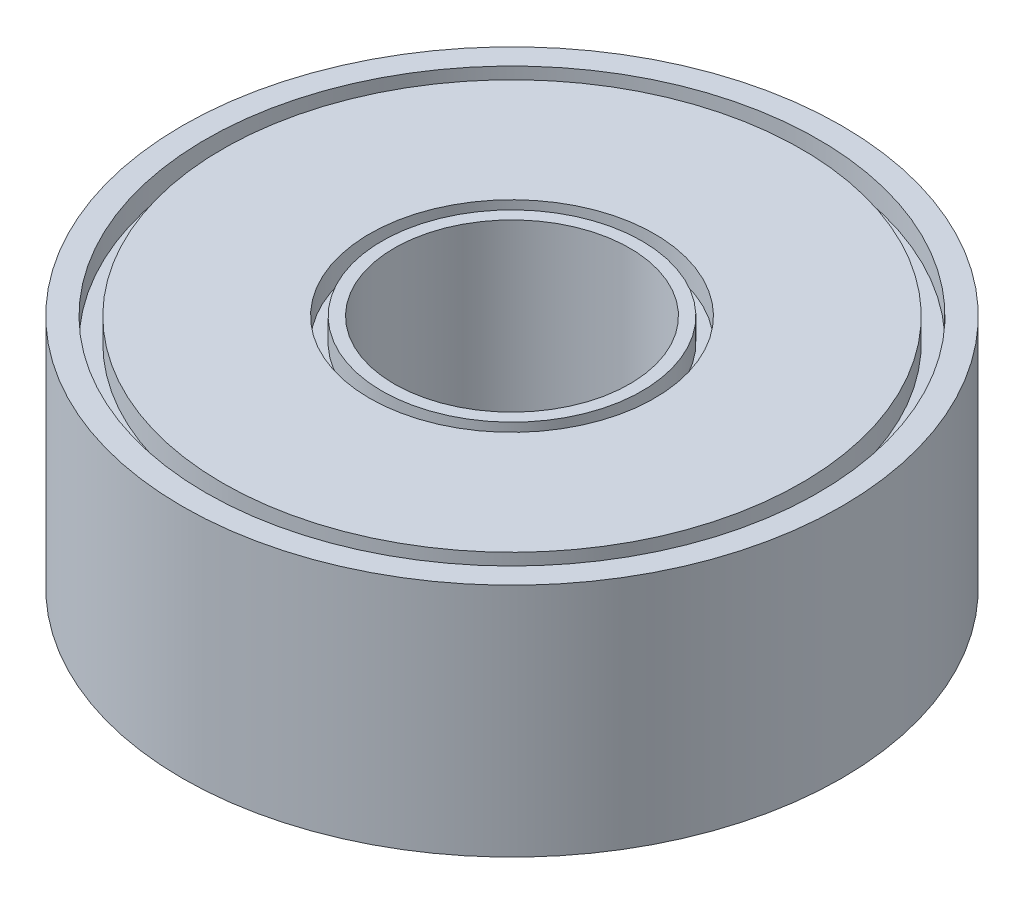
ISO-10303-21;
HEADER;
FILE_DESCRIPTION(('STEP AP214'),'2;1');
FILE_NAME('part.step','',(''),(''),'','','');
FILE_SCHEMA(('AUTOMOTIVE_DESIGN { 1 0 10303 214 1 1 1 1 }'));
ENDSEC;
DATA;
#1=APPLICATION_CONTEXT('core data for automotive mechanical design processes');
#2=APPLICATION_PROTOCOL_DEFINITION('international standard','automotive_design',2000,#1);
#3=PRODUCT_CONTEXT('',#1,'mechanical');
#4=PRODUCT('Part','Part','',(#3));
#5=PRODUCT_RELATED_PRODUCT_CATEGORY('part','',(#4));
#6=PRODUCT_DEFINITION_FORMATION('','',#4);
#7=PRODUCT_DEFINITION_CONTEXT('part definition',#1,'design');
#8=PRODUCT_DEFINITION('design','',#6,#7);
#9=PRODUCT_DEFINITION_SHAPE('','',#8);
#10=(LENGTH_UNIT() NAMED_UNIT(*) SI_UNIT(.MILLI.,.METRE.));
#11=(NAMED_UNIT(*) PLANE_ANGLE_UNIT() SI_UNIT($,.RADIAN.));
#12=(NAMED_UNIT(*) SI_UNIT($,.STERADIAN.) SOLID_ANGLE_UNIT());
#13=UNCERTAINTY_MEASURE_WITH_UNIT(LENGTH_MEASURE(1.E-05),#10,'distance_accuracy_value','');
#14=(GEOMETRIC_REPRESENTATION_CONTEXT(3) GLOBAL_UNCERTAINTY_ASSIGNED_CONTEXT((#13)) GLOBAL_UNIT_ASSIGNED_CONTEXT((#10,
#11,#12)) REPRESENTATION_CONTEXT('',''));
#15=CARTESIAN_POINT('',(0.,0.,0.));
#16=DIRECTION('',(0.,0.,1.));
#17=DIRECTION('',(1.,0.,0.));
#18=AXIS2_PLACEMENT_3D('',#15,#16,#17);
#19=CARTESIAN_POINT('',(0.,0.,0.));
#20=DIRECTION('',(0.,1.,0.));
#21=DIRECTION('',(0.,0.,1.));
#22=AXIS2_PLACEMENT_3D('',#19,#20,#21);
#23=PLANE('',#22);
#24=CARTESIAN_POINT('',(0.,0.,0.));
#25=DIRECTION('',(0.,-1.,0.));
#26=DIRECTION('',(0.,0.,-1.));
#27=AXIS2_PLACEMENT_3D('',#24,#25,#26);
#28=CIRCLE('',#27,3.2118954980683);
#29=CARTESIAN_POINT('',(0.,0.,-3.2118954980683));
#30=VERTEX_POINT('',#29);
#31=EDGE_CURVE('E111',#30,#30,#28,.T.);
#32=ORIENTED_EDGE('',*,*,#31,.F.);
#33=EDGE_LOOP('',(#32));
#34=FACE_BOUND('',#33,.T.);
#35=CARTESIAN_POINT('',(0.,0.,0.));
#36=DIRECTION('',(0.,-1.,0.));
#37=DIRECTION('',(0.,0.,-1.));
#38=AXIS2_PLACEMENT_3D('',#35,#36,#37);
#39=CIRCLE('',#38,6.40297161324171);
#40=CARTESIAN_POINT('',(0.,0.,-6.40297161324171));
#41=VERTEX_POINT('',#40);
#42=EDGE_CURVE('E120',#41,#41,#39,.T.);
#43=ORIENTED_EDGE('',*,*,#42,.T.);
#44=EDGE_LOOP('',(#43));
#45=FACE_BOUND('',#44,.T.);
#46=ADVANCED_FACE('F68',(#34,#45),#23,.F.);
#47=CARTESIAN_POINT('',(0.,0.,0.));
#48=DIRECTION('',(0.,1.,0.));
#49=DIRECTION('',(0.,0.,1.));
#50=AXIS2_PLACEMENT_3D('',#47,#48,#49);
#51=CIRCLE('',#50,2.5);
#52=CARTESIAN_POINT('',(0.,0.,2.5));
#53=VERTEX_POINT('',#52);
#54=EDGE_CURVE('E81',#53,#53,#51,.T.);
#55=ORIENTED_EDGE('',*,*,#54,.T.);
#56=EDGE_LOOP('',(#55));
#57=FACE_BOUND('',#56,.T.);
#58=CARTESIAN_POINT('',(0.,0.,0.));
#59=DIRECTION('',(0.,-1.,0.));
#60=DIRECTION('',(0.,0.,-1.));
#61=AXIS2_PLACEMENT_3D('',#58,#59,#60);
#62=CIRCLE('',#61,2.91485272981181);
#63=CARTESIAN_POINT('',(0.,0.,-2.91485272981181));
#64=VERTEX_POINT('',#63);
#65=EDGE_CURVE('E117',#64,#64,#62,.T.);
#66=ORIENTED_EDGE('',*,*,#65,.T.);
#67=EDGE_LOOP('',(#66));
#68=FACE_BOUND('',#67,.T.);
#69=ADVANCED_FACE('F141',(#57,#68),#23,.F.);
#70=CARTESIAN_POINT('',(0.,5.,0.));
#71=DIRECTION('',(0.,1.,0.));
#72=DIRECTION('',(0.,0.,1.));
#73=AXIS2_PLACEMENT_3D('',#70,#71,#72);
#74=PLANE('',#73);
#75=CARTESIAN_POINT('',(0.,5.,0.));
#76=DIRECTION('',(0.,1.,0.));
#77=DIRECTION('',(0.,0.,1.));
#78=AXIS2_PLACEMENT_3D('',#75,#76,#77);
#79=CIRCLE('',#78,3.02471914204805);
#80=CARTESIAN_POINT('',(0.,5.,3.02471914204805));
#81=VERTEX_POINT('',#80);
#82=EDGE_CURVE('E87',#81,#81,#79,.T.);
#83=ORIENTED_EDGE('',*,*,#82,.F.);
#84=EDGE_LOOP('',(#83));
#85=FACE_BOUND('',#84,.T.);
#86=CARTESIAN_POINT('',(0.,5.,0.));
#87=DIRECTION('',(0.,1.,0.));
#88=DIRECTION('',(0.,0.,1.));
#89=AXIS2_PLACEMENT_3D('',#86,#87,#88);
#90=CIRCLE('',#89,6.14365339120584);
#91=CARTESIAN_POINT('',(0.,5.,6.14365339120584));
#92=VERTEX_POINT('',#91);
#93=EDGE_CURVE('E105',#92,#92,#90,.T.);
#94=ORIENTED_EDGE('',*,*,#93,.T.);
#95=EDGE_LOOP('',(#94));
#96=FACE_BOUND('',#95,.T.);
#97=ADVANCED_FACE('F158',(#85,#96),#74,.T.);
#98=CARTESIAN_POINT('',(0.,5.,0.));
#99=DIRECTION('',(0.,1.,0.));
#100=DIRECTION('',(0.,0.,1.));
#101=AXIS2_PLACEMENT_3D('',#98,#99,#100);
#102=CIRCLE('',#101,2.5);
#103=CARTESIAN_POINT('',(0.,5.,2.5));
#104=VERTEX_POINT('',#103);
#105=EDGE_CURVE('E79',#104,#104,#102,.T.);
#106=ORIENTED_EDGE('',*,*,#105,.F.);
#107=EDGE_LOOP('',(#106));
#108=FACE_BOUND('',#107,.T.);
#109=CARTESIAN_POINT('',(0.,5.,0.));
#110=DIRECTION('',(0.,1.,0.));
#111=DIRECTION('',(0.,0.,1.));
#112=AXIS2_PLACEMENT_3D('',#109,#110,#111);
#113=CIRCLE('',#112,2.76023768733502);
#114=CARTESIAN_POINT('',(0.,5.,2.76023768733502));
#115=VERTEX_POINT('',#114);
#116=EDGE_CURVE('E93',#115,#115,#113,.T.);
#117=ORIENTED_EDGE('',*,*,#116,.T.);
#118=EDGE_LOOP('',(#117));
#119=FACE_BOUND('',#118,.T.);
#120=ADVANCED_FACE('F164',(#108,#119),#74,.T.);
#121=CARTESIAN_POINT('',(0.,5.,0.));
#122=DIRECTION('',(0.,1.,0.));
#123=DIRECTION('',(0.,0.,1.));
#124=AXIS2_PLACEMENT_3D('',#121,#122,#123);
#125=CIRCLE('',#124,6.50095153113644);
#126=CARTESIAN_POINT('',(0.,5.,6.50095153113644));
#127=VERTEX_POINT('',#126);
#128=EDGE_CURVE('E99',#127,#127,#125,.T.);
#129=ORIENTED_EDGE('',*,*,#128,.F.);
#130=EDGE_LOOP('',(#129));
#131=FACE_BOUND('',#130,.T.);
#132=CARTESIAN_POINT('',(0.,5.,0.));
#133=DIRECTION('',(0.,1.,0.));
#134=DIRECTION('',(0.,0.,1.));
#135=AXIS2_PLACEMENT_3D('',#132,#133,#134);
#136=CIRCLE('',#135,7.);
#137=CARTESIAN_POINT('',(0.,5.,7.));
#138=VERTEX_POINT('',#137);
#139=EDGE_CURVE('E11',#138,#138,#136,.T.);
#140=ORIENTED_EDGE('',*,*,#139,.T.);
#141=EDGE_LOOP('',(#140));
#142=FACE_BOUND('',#141,.T.);
#143=ADVANCED_FACE('F140',(#131,#142),#74,.T.);
#144=CARTESIAN_POINT('',(0.,0.,0.));
#145=DIRECTION('',(0.,-1.,0.));
#146=DIRECTION('',(0.,0.,-1.));
#147=AXIS2_PLACEMENT_3D('',#144,#145,#146);
#148=CIRCLE('',#147,6.65368552850897);
#149=CARTESIAN_POINT('',(0.,0.,-6.65368552850897));
#150=VERTEX_POINT('',#149);
#151=EDGE_CURVE('E126',#150,#150,#148,.T.);
#152=ORIENTED_EDGE('',*,*,#151,.F.);
#153=EDGE_LOOP('',(#152));
#154=FACE_BOUND('',#153,.T.);
#155=CARTESIAN_POINT('',(0.,0.,0.));
#156=DIRECTION('',(0.,1.,0.));
#157=DIRECTION('',(0.,0.,1.));
#158=AXIS2_PLACEMENT_3D('',#155,#156,#157);
#159=CIRCLE('',#158,7.);
#160=CARTESIAN_POINT('',(0.,0.,7.));
#161=VERTEX_POINT('',#160);
#162=EDGE_CURVE('E72',#161,#161,#159,.T.);
#163=ORIENTED_EDGE('',*,*,#162,.F.);
#164=EDGE_LOOP('',(#163));
#165=FACE_BOUND('',#164,.T.);
#166=ADVANCED_FACE('F137',(#154,#165),#23,.F.);
#167=CARTESIAN_POINT('',(0.,5.,0.));
#168=DIRECTION('',(0.,-1.,0.));
#169=DIRECTION('',(0.,0.,-1.));
#170=AXIS2_PLACEMENT_3D('',#167,#168,#169);
#171=CYLINDRICAL_SURFACE('',#170,7.);
#172=ORIENTED_EDGE('',*,*,#139,.F.);
#173=EDGE_LOOP('',(#172));
#174=FACE_BOUND('',#173,.T.);
#175=ORIENTED_EDGE('',*,*,#162,.T.);
#176=EDGE_LOOP('',(#175));
#177=FACE_BOUND('',#176,.T.);
#178=ADVANCED_FACE('F70',(#174,#177),#171,.T.);
#179=CARTESIAN_POINT('',(0.,5.,0.));
#180=DIRECTION('',(0.,-1.,0.));
#181=DIRECTION('',(0.,0.,-1.));
#182=AXIS2_PLACEMENT_3D('',#179,#180,#181);
#183=CYLINDRICAL_SURFACE('',#182,2.5);
#184=ORIENTED_EDGE('',*,*,#105,.T.);
#185=EDGE_LOOP('',(#184));
#186=FACE_BOUND('',#185,.T.);
#187=ORIENTED_EDGE('',*,*,#54,.F.);
#188=EDGE_LOOP('',(#187));
#189=FACE_BOUND('',#188,.T.);
#190=ADVANCED_FACE('F145',(#186,#189),#183,.F.);
#191=CARTESIAN_POINT('',(0.,4.5,0.));
#192=DIRECTION('',(0.,1.,0.));
#193=DIRECTION('',(0.,0.,1.));
#194=AXIS2_PLACEMENT_3D('',#191,#192,#193);
#195=CYLINDRICAL_SURFACE('',#194,3.02471914204805);
#196=CARTESIAN_POINT('',(0.,4.5,0.));
#197=DIRECTION('',(0.,1.,0.));
#198=DIRECTION('',(0.,0.,1.));
#199=AXIS2_PLACEMENT_3D('',#196,#197,#198);
#200=CIRCLE('',#199,3.02471914204805);
#201=CARTESIAN_POINT('',(0.,4.5,3.02471914204805));
#202=VERTEX_POINT('',#201);
#203=EDGE_CURVE('E84',#202,#202,#200,.T.);
#204=ORIENTED_EDGE('',*,*,#203,.F.);
#205=EDGE_LOOP('',(#204));
#206=FACE_BOUND('',#205,.T.);
#207=ORIENTED_EDGE('',*,*,#82,.T.);
#208=EDGE_LOOP('',(#207));
#209=FACE_BOUND('',#208,.T.);
#210=ADVANCED_FACE('F150',(#206,#209),#195,.F.);
#211=CARTESIAN_POINT('',(0.,4.5,0.));
#212=DIRECTION('',(0.,1.,0.));
#213=DIRECTION('',(0.,0.,1.));
#214=AXIS2_PLACEMENT_3D('',#211,#212,#213);
#215=PLANE('',#214);
#216=CARTESIAN_POINT('',(0.,4.5,0.));
#217=DIRECTION('',(0.,1.,0.));
#218=DIRECTION('',(0.,0.,1.));
#219=AXIS2_PLACEMENT_3D('',#216,#217,#218);
#220=CIRCLE('',#219,2.76023768733502);
#221=CARTESIAN_POINT('',(0.,4.5,2.76023768733502));
#222=VERTEX_POINT('',#221);
#223=EDGE_CURVE('E90',#222,#222,#220,.T.);
#224=ORIENTED_EDGE('',*,*,#223,.F.);
#225=EDGE_LOOP('',(#224));
#226=FACE_BOUND('',#225,.T.);
#227=ORIENTED_EDGE('',*,*,#203,.T.);
#228=EDGE_LOOP('',(#227));
#229=FACE_BOUND('',#228,.T.);
#230=ADVANCED_FACE('F169',(#226,#229),#215,.T.);
#231=CARTESIAN_POINT('',(0.,4.5,0.));
#232=DIRECTION('',(0.,1.,0.));
#233=DIRECTION('',(0.,0.,1.));
#234=AXIS2_PLACEMENT_3D('',#231,#232,#233);
#235=CYLINDRICAL_SURFACE('',#234,2.76023768733502);
#236=ORIENTED_EDGE('',*,*,#223,.T.);
#237=EDGE_LOOP('',(#236));
#238=FACE_BOUND('',#237,.T.);
#239=ORIENTED_EDGE('',*,*,#116,.F.);
#240=EDGE_LOOP('',(#239));
#241=FACE_BOUND('',#240,.T.);
#242=ADVANCED_FACE('F173',(#238,#241),#235,.T.);
#243=CARTESIAN_POINT('',(0.,4.5,0.));
#244=DIRECTION('',(0.,1.,0.));
#245=DIRECTION('',(0.,0.,1.));
#246=AXIS2_PLACEMENT_3D('',#243,#244,#245);
#247=CYLINDRICAL_SURFACE('',#246,6.50095153113644);
#248=CARTESIAN_POINT('',(0.,4.5,0.));
#249=DIRECTION('',(0.,1.,0.));
#250=DIRECTION('',(0.,0.,1.));
#251=AXIS2_PLACEMENT_3D('',#248,#249,#250);
#252=CIRCLE('',#251,6.50095153113644);
#253=CARTESIAN_POINT('',(0.,4.5,6.50095153113644));
#254=VERTEX_POINT('',#253);
#255=EDGE_CURVE('E96',#254,#254,#252,.T.);
#256=ORIENTED_EDGE('',*,*,#255,.F.);
#257=EDGE_LOOP('',(#256));
#258=FACE_BOUND('',#257,.T.);
#259=ORIENTED_EDGE('',*,*,#128,.T.);
#260=EDGE_LOOP('',(#259));
#261=FACE_BOUND('',#260,.T.);
#262=ADVANCED_FACE('F177',(#258,#261),#247,.F.);
#263=CARTESIAN_POINT('',(0.,4.5,0.));
#264=DIRECTION('',(0.,1.,0.));
#265=DIRECTION('',(0.,0.,1.));
#266=AXIS2_PLACEMENT_3D('',#263,#264,#265);
#267=PLANE('',#266);
#268=CARTESIAN_POINT('',(0.,4.5,0.));
#269=DIRECTION('',(0.,1.,0.));
#270=DIRECTION('',(0.,0.,1.));
#271=AXIS2_PLACEMENT_3D('',#268,#269,#270);
#272=CIRCLE('',#271,6.14365339120584);
#273=CARTESIAN_POINT('',(0.,4.5,6.14365339120584));
#274=VERTEX_POINT('',#273);
#275=EDGE_CURVE('E102',#274,#274,#272,.T.);
#276=ORIENTED_EDGE('',*,*,#275,.F.);
#277=EDGE_LOOP('',(#276));
#278=FACE_BOUND('',#277,.T.);
#279=ORIENTED_EDGE('',*,*,#255,.T.);
#280=EDGE_LOOP('',(#279));
#281=FACE_BOUND('',#280,.T.);
#282=ADVANCED_FACE('F181',(#278,#281),#267,.T.);
#283=CARTESIAN_POINT('',(0.,4.5,0.));
#284=DIRECTION('',(0.,1.,0.));
#285=DIRECTION('',(0.,0.,1.));
#286=AXIS2_PLACEMENT_3D('',#283,#284,#285);
#287=CYLINDRICAL_SURFACE('',#286,6.14365339120584);
#288=ORIENTED_EDGE('',*,*,#275,.T.);
#289=EDGE_LOOP('',(#288));
#290=FACE_BOUND('',#289,.T.);
#291=ORIENTED_EDGE('',*,*,#93,.F.);
#292=EDGE_LOOP('',(#291));
#293=FACE_BOUND('',#292,.T.);
#294=ADVANCED_FACE('F185',(#290,#293),#287,.T.);
#295=CARTESIAN_POINT('',(0.,0.5,0.));
#296=DIRECTION('',(0.,-1.,0.));
#297=DIRECTION('',(0.,0.,-1.));
#298=AXIS2_PLACEMENT_3D('',#295,#296,#297);
#299=CYLINDRICAL_SURFACE('',#298,3.2118954980683);
#300=CARTESIAN_POINT('',(0.,0.5,0.));
#301=DIRECTION('',(0.,-1.,0.));
#302=DIRECTION('',(0.,0.,-1.));
#303=AXIS2_PLACEMENT_3D('',#300,#301,#302);
#304=CIRCLE('',#303,3.2118954980683);
#305=CARTESIAN_POINT('',(0.,0.5,-3.2118954980683));
#306=VERTEX_POINT('',#305);
#307=EDGE_CURVE('E108',#306,#306,#304,.T.);
#308=ORIENTED_EDGE('',*,*,#307,.F.);
#309=EDGE_LOOP('',(#308));
#310=FACE_BOUND('',#309,.T.);
#311=ORIENTED_EDGE('',*,*,#31,.T.);
#312=EDGE_LOOP('',(#311));
#313=FACE_BOUND('',#312,.T.);
#314=ADVANCED_FACE('F189',(#310,#313),#299,.F.);
#315=CARTESIAN_POINT('',(0.,0.5,0.));
#316=DIRECTION('',(0.,-1.,0.));
#317=DIRECTION('',(0.,0.,-1.));
#318=AXIS2_PLACEMENT_3D('',#315,#316,#317);
#319=PLANE('',#318);
#320=CARTESIAN_POINT('',(0.,0.5,0.));
#321=DIRECTION('',(0.,-1.,0.));
#322=DIRECTION('',(0.,0.,-1.));
#323=AXIS2_PLACEMENT_3D('',#320,#321,#322);
#324=CIRCLE('',#323,2.91485272981181);
#325=CARTESIAN_POINT('',(0.,0.5,-2.91485272981181));
#326=VERTEX_POINT('',#325);
#327=EDGE_CURVE('E114',#326,#326,#324,.T.);
#328=ORIENTED_EDGE('',*,*,#327,.F.);
#329=EDGE_LOOP('',(#328));
#330=FACE_BOUND('',#329,.T.);
#331=ORIENTED_EDGE('',*,*,#307,.T.);
#332=EDGE_LOOP('',(#331));
#333=FACE_BOUND('',#332,.T.);
#334=ADVANCED_FACE('F193',(#330,#333),#319,.T.);
#335=CARTESIAN_POINT('',(0.,0.5,0.));
#336=DIRECTION('',(0.,-1.,0.));
#337=DIRECTION('',(0.,0.,-1.));
#338=AXIS2_PLACEMENT_3D('',#335,#336,#337);
#339=CYLINDRICAL_SURFACE('',#338,2.91485272981181);
#340=ORIENTED_EDGE('',*,*,#327,.T.);
#341=EDGE_LOOP('',(#340));
#342=FACE_BOUND('',#341,.T.);
#343=ORIENTED_EDGE('',*,*,#65,.F.);
#344=EDGE_LOOP('',(#343));
#345=FACE_BOUND('',#344,.T.);
#346=ADVANCED_FACE('F197',(#342,#345),#339,.T.);
#347=CARTESIAN_POINT('',(0.,0.5,0.));
#348=DIRECTION('',(0.,-1.,0.));
#349=DIRECTION('',(0.,0.,-1.));
#350=AXIS2_PLACEMENT_3D('',#347,#348,#349);
#351=CYLINDRICAL_SURFACE('',#350,6.65368552850897);
#352=CARTESIAN_POINT('',(0.,0.5,0.));
#353=DIRECTION('',(0.,-1.,0.));
#354=DIRECTION('',(0.,0.,-1.));
#355=AXIS2_PLACEMENT_3D('',#352,#353,#354);
#356=CIRCLE('',#355,6.65368552850897);
#357=CARTESIAN_POINT('',(0.,0.5,-6.65368552850897));
#358=VERTEX_POINT('',#357);
#359=EDGE_CURVE('E129',#358,#358,#356,.T.);
#360=ORIENTED_EDGE('',*,*,#359,.F.);
#361=EDGE_LOOP('',(#360));
#362=FACE_BOUND('',#361,.T.);
#363=ORIENTED_EDGE('',*,*,#151,.T.);
#364=EDGE_LOOP('',(#363));
#365=FACE_BOUND('',#364,.T.);
#366=ADVANCED_FACE('F135',(#362,#365),#351,.F.);
#367=CARTESIAN_POINT('',(0.,0.5,0.));
#368=DIRECTION('',(0.,-1.,0.));
#369=DIRECTION('',(0.,0.,-1.));
#370=AXIS2_PLACEMENT_3D('',#367,#368,#369);
#371=PLANE('',#370);
#372=CARTESIAN_POINT('',(0.,0.5,0.));
#373=DIRECTION('',(0.,-1.,0.));
#374=DIRECTION('',(0.,0.,-1.));
#375=AXIS2_PLACEMENT_3D('',#372,#373,#374);
#376=CIRCLE('',#375,6.40297161324171);
#377=CARTESIAN_POINT('',(0.,0.5,-6.40297161324171));
#378=VERTEX_POINT('',#377);
#379=EDGE_CURVE('E123',#378,#378,#376,.T.);
#380=ORIENTED_EDGE('',*,*,#379,.F.);
#381=EDGE_LOOP('',(#380));
#382=FACE_BOUND('',#381,.T.);
#383=ORIENTED_EDGE('',*,*,#359,.T.);
#384=EDGE_LOOP('',(#383));
#385=FACE_BOUND('',#384,.T.);
#386=ADVANCED_FACE('F205',(#382,#385),#371,.T.);
#387=CARTESIAN_POINT('',(0.,0.5,0.));
#388=DIRECTION('',(0.,-1.,0.));
#389=DIRECTION('',(0.,0.,-1.));
#390=AXIS2_PLACEMENT_3D('',#387,#388,#389);
#391=CYLINDRICAL_SURFACE('',#390,6.40297161324171);
#392=ORIENTED_EDGE('',*,*,#379,.T.);
#393=EDGE_LOOP('',(#392));
#394=FACE_BOUND('',#393,.T.);
#395=ORIENTED_EDGE('',*,*,#42,.F.);
#396=EDGE_LOOP('',(#395));
#397=FACE_BOUND('',#396,.T.);
#398=ADVANCED_FACE('F202',(#394,#397),#391,.T.);
#399=CLOSED_SHELL('',(#46,#69,#97,#120,#143,#166,#178,#190,#210,#230,#242,#262,#282,#294,#314,
#334,#346,#366,#386,#398));
#400=MANIFOLD_SOLID_BREP('B2',#399);
#401=ADVANCED_BREP_SHAPE_REPRESENTATION('',(#18,#400),#14);
#402=SHAPE_DEFINITION_REPRESENTATION(#9,#401);
ENDSEC;
END-ISO-10303-21;
